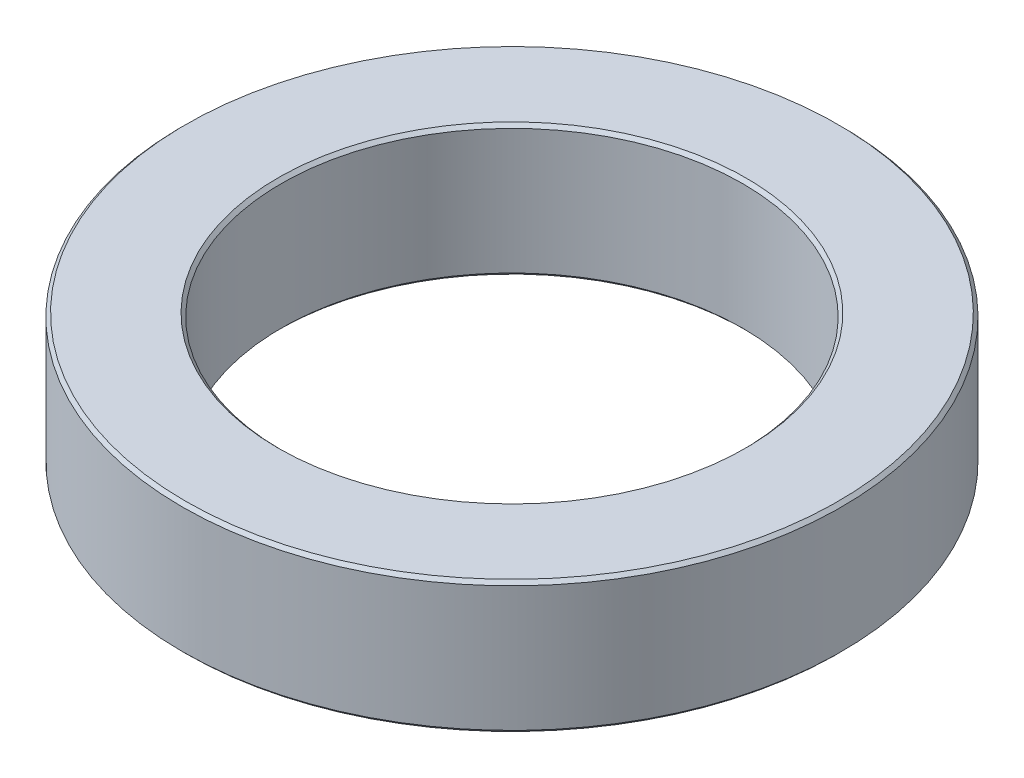
ISO-10303-21;
HEADER;
FILE_DESCRIPTION(('STEP AP214'),'2;1');
FILE_NAME('part.step','',(''),(''),'','','');
FILE_SCHEMA(('AUTOMOTIVE_DESIGN { 1 0 10303 214 1 1 1 1 }'));
ENDSEC;
DATA;
#1=APPLICATION_CONTEXT('core data for automotive mechanical design processes');
#2=APPLICATION_PROTOCOL_DEFINITION('international standard','automotive_design',2000,#1);
#3=PRODUCT_CONTEXT('',#1,'mechanical');
#4=PRODUCT('Part','Part','',(#3));
#5=PRODUCT_RELATED_PRODUCT_CATEGORY('part','',(#4));
#6=PRODUCT_DEFINITION_FORMATION('','',#4);
#7=PRODUCT_DEFINITION_CONTEXT('part definition',#1,'design');
#8=PRODUCT_DEFINITION('design','',#6,#7);
#9=PRODUCT_DEFINITION_SHAPE('','',#8);
#10=(LENGTH_UNIT() NAMED_UNIT(*) SI_UNIT(.MILLI.,.METRE.));
#11=(NAMED_UNIT(*) PLANE_ANGLE_UNIT() SI_UNIT($,.RADIAN.));
#12=(NAMED_UNIT(*) SI_UNIT($,.STERADIAN.) SOLID_ANGLE_UNIT());
#13=UNCERTAINTY_MEASURE_WITH_UNIT(LENGTH_MEASURE(1.E-05),#10,'distance_accuracy_value','');
#14=(GEOMETRIC_REPRESENTATION_CONTEXT(3) GLOBAL_UNCERTAINTY_ASSIGNED_CONTEXT((#13)) GLOBAL_UNIT_ASSIGNED_CONTEXT((#10,
#11,#12)) REPRESENTATION_CONTEXT('',''));
#15=CARTESIAN_POINT('',(0.,0.,0.));
#16=DIRECTION('',(0.,0.,1.));
#17=DIRECTION('',(1.,0.,0.));
#18=AXIS2_PLACEMENT_3D('',#15,#16,#17);
#19=CARTESIAN_POINT('',(0.,4.,0.));
#20=DIRECTION('',(0.,1.,0.));
#21=DIRECTION('',(0.,0.,1.));
#22=AXIS2_PLACEMENT_3D('',#19,#20,#21);
#23=PLANE('',#22);
#24=CARTESIAN_POINT('',(0.,4.,0.));
#25=DIRECTION('',(0.,1.,0.));
#26=DIRECTION('',(0.,0.,1.));
#27=AXIS2_PLACEMENT_3D('',#24,#25,#26);
#28=CIRCLE('',#27,14.2);
#29=CARTESIAN_POINT('',(0.,4.,14.2));
#30=VERTEX_POINT('',#29);
#31=EDGE_CURVE('E53',#30,#30,#28,.F.);
#32=ORIENTED_EDGE('',*,*,#31,.T.);
#33=EDGE_LOOP('',(#32));
#34=FACE_BOUND('',#33,.T.);
#35=CARTESIAN_POINT('',(0.,4.,0.));
#36=DIRECTION('',(0.,1.,0.));
#37=DIRECTION('',(0.,0.,1.));
#38=AXIS2_PLACEMENT_3D('',#35,#36,#37);
#39=CIRCLE('',#38,19.8);
#40=CARTESIAN_POINT('',(0.,4.,19.8));
#41=VERTEX_POINT('',#40);
#42=EDGE_CURVE('E56',#41,#41,#39,.T.);
#43=ORIENTED_EDGE('',*,*,#42,.T.);
#44=EDGE_LOOP('',(#43));
#45=FACE_BOUND('',#44,.T.);
#46=ADVANCED_FACE('F32',(#34,#45),#23,.T.);
#47=CARTESIAN_POINT('',(0.,-4.,0.));
#48=DIRECTION('',(0.,1.,0.));
#49=DIRECTION('',(0.,0.,1.));
#50=AXIS2_PLACEMENT_3D('',#47,#48,#49);
#51=PLANE('',#50);
#52=CARTESIAN_POINT('',(0.,-4.,0.));
#53=DIRECTION('',(0.,1.,0.));
#54=DIRECTION('',(0.,0.,1.));
#55=AXIS2_PLACEMENT_3D('',#52,#53,#54);
#56=CIRCLE('',#55,14.2);
#57=CARTESIAN_POINT('',(0.,-4.,14.2));
#58=VERTEX_POINT('',#57);
#59=EDGE_CURVE('E10',#58,#58,#56,.T.);
#60=ORIENTED_EDGE('',*,*,#59,.T.);
#61=EDGE_LOOP('',(#60));
#62=FACE_BOUND('',#61,.T.);
#63=CARTESIAN_POINT('',(0.,-4.,0.));
#64=DIRECTION('',(0.,1.,0.));
#65=DIRECTION('',(0.,0.,1.));
#66=AXIS2_PLACEMENT_3D('',#63,#64,#65);
#67=CIRCLE('',#66,19.8);
#68=CARTESIAN_POINT('',(0.,-4.,19.8));
#69=VERTEX_POINT('',#68);
#70=EDGE_CURVE('E40',#69,#69,#67,.F.);
#71=ORIENTED_EDGE('',*,*,#70,.T.);
#72=EDGE_LOOP('',(#71));
#73=FACE_BOUND('',#72,.T.);
#74=ADVANCED_FACE('F82',(#62,#73),#51,.F.);
#75=CARTESIAN_POINT('',(0.,4.,0.));
#76=DIRECTION('',(0.,-1.,0.));
#77=DIRECTION('',(0.,0.,-1.));
#78=AXIS2_PLACEMENT_3D('',#75,#76,#77);
#79=CYLINDRICAL_SURFACE('',#78,20.);
#80=CARTESIAN_POINT('',(0.,3.80000000000002,0.));
#81=DIRECTION('',(0.,1.,0.));
#82=DIRECTION('',(0.,0.,1.));
#83=AXIS2_PLACEMENT_3D('',#80,#81,#82);
#84=CIRCLE('',#83,20.);
#85=CARTESIAN_POINT('',(0.,3.80000000000002,20.));
#86=VERTEX_POINT('',#85);
#87=EDGE_CURVE('E44',#86,#86,#84,.F.);
#88=ORIENTED_EDGE('',*,*,#87,.T.);
#89=EDGE_LOOP('',(#88));
#90=FACE_BOUND('',#89,.T.);
#91=CARTESIAN_POINT('',(0.,-3.8,0.));
#92=DIRECTION('',(0.,1.,0.));
#93=DIRECTION('',(0.,0.,1.));
#94=AXIS2_PLACEMENT_3D('',#91,#92,#93);
#95=CIRCLE('',#94,20.);
#96=CARTESIAN_POINT('',(0.,-3.8,20.));
#97=VERTEX_POINT('',#96);
#98=EDGE_CURVE('E48',#97,#97,#95,.T.);
#99=ORIENTED_EDGE('',*,*,#98,.T.);
#100=EDGE_LOOP('',(#99));
#101=FACE_BOUND('',#100,.T.);
#102=ADVANCED_FACE('F88',(#90,#101),#79,.T.);
#103=CARTESIAN_POINT('',(0.,4.,0.));
#104=DIRECTION('',(0.,-1.,0.));
#105=DIRECTION('',(0.,0.,-1.));
#106=AXIS2_PLACEMENT_3D('',#103,#104,#105);
#107=CYLINDRICAL_SURFACE('',#106,14.);
#108=CARTESIAN_POINT('',(0.,3.8,0.));
#109=DIRECTION('',(0.,1.,0.));
#110=DIRECTION('',(0.,0.,1.));
#111=AXIS2_PLACEMENT_3D('',#108,#109,#110);
#112=CIRCLE('',#111,14.);
#113=CARTESIAN_POINT('',(0.,3.8,14.));
#114=VERTEX_POINT('',#113);
#115=EDGE_CURVE('E59',#114,#114,#112,.T.);
#116=ORIENTED_EDGE('',*,*,#115,.T.);
#117=EDGE_LOOP('',(#116));
#118=FACE_BOUND('',#117,.T.);
#119=CARTESIAN_POINT('',(0.,-3.8,0.));
#120=DIRECTION('',(0.,1.,0.));
#121=DIRECTION('',(0.,0.,1.));
#122=AXIS2_PLACEMENT_3D('',#119,#120,#121);
#123=CIRCLE('',#122,14.);
#124=CARTESIAN_POINT('',(0.,-3.8,14.));
#125=VERTEX_POINT('',#124);
#126=EDGE_CURVE('E62',#125,#125,#123,.F.);
#127=ORIENTED_EDGE('',*,*,#126,.T.);
#128=EDGE_LOOP('',(#127));
#129=FACE_BOUND('',#128,.T.);
#130=ADVANCED_FACE('F66',(#118,#129),#107,.F.);
#131=CARTESIAN_POINT('',(0.,3.8,0.));
#132=DIRECTION('',(0.,1.,0.));
#133=DIRECTION('',(0.,0.,1.));
#134=AXIS2_PLACEMENT_3D('',#131,#132,#133);
#135=CONICAL_SURFACE('',#134,14.,0.785398163397466);
#136=ORIENTED_EDGE('',*,*,#31,.F.);
#137=EDGE_LOOP('',(#136));
#138=FACE_BOUND('',#137,.T.);
#139=ORIENTED_EDGE('',*,*,#115,.F.);
#140=EDGE_LOOP('',(#139));
#141=FACE_BOUND('',#140,.T.);
#142=ADVANCED_FACE('F77',(#138,#141),#135,.F.);
#143=CARTESIAN_POINT('',(0.,4.,0.));
#144=DIRECTION('',(0.,-1.,0.));
#145=DIRECTION('',(0.,0.,-1.));
#146=AXIS2_PLACEMENT_3D('',#143,#144,#145);
#147=CONICAL_SURFACE('',#146,19.8,0.785398163397448);
#148=ORIENTED_EDGE('',*,*,#87,.F.);
#149=EDGE_LOOP('',(#148));
#150=FACE_BOUND('',#149,.T.);
#151=ORIENTED_EDGE('',*,*,#42,.F.);
#152=EDGE_LOOP('',(#151));
#153=FACE_BOUND('',#152,.T.);
#154=ADVANCED_FACE('F71',(#150,#153),#147,.T.);
#155=CARTESIAN_POINT('',(0.,-4.,0.));
#156=DIRECTION('',(0.,-1.,0.));
#157=DIRECTION('',(0.,0.,-1.));
#158=AXIS2_PLACEMENT_3D('',#155,#156,#157);
#159=CONICAL_SURFACE('',#158,14.2,0.785398163397435);
#160=ORIENTED_EDGE('',*,*,#126,.F.);
#161=EDGE_LOOP('',(#160));
#162=FACE_BOUND('',#161,.T.);
#163=ORIENTED_EDGE('',*,*,#59,.F.);
#164=EDGE_LOOP('',(#163));
#165=FACE_BOUND('',#164,.T.);
#166=ADVANCED_FACE('F68',(#162,#165),#159,.F.);
#167=CARTESIAN_POINT('',(0.,-3.8,0.));
#168=DIRECTION('',(0.,1.,0.));
#169=DIRECTION('',(0.,0.,1.));
#170=AXIS2_PLACEMENT_3D('',#167,#168,#169);
#171=CONICAL_SURFACE('',#170,20.,0.785398163397457);
#172=ORIENTED_EDGE('',*,*,#70,.F.);
#173=EDGE_LOOP('',(#172));
#174=FACE_BOUND('',#173,.T.);
#175=ORIENTED_EDGE('',*,*,#98,.F.);
#176=EDGE_LOOP('',(#175));
#177=FACE_BOUND('',#176,.T.);
#178=ADVANCED_FACE('F35',(#174,#177),#171,.T.);
#179=CLOSED_SHELL('',(#46,#74,#102,#130,#142,#154,#166,#178));
#180=MANIFOLD_SOLID_BREP('B2',#179);
#181=ADVANCED_BREP_SHAPE_REPRESENTATION('',(#18,#180),#14);
#182=SHAPE_DEFINITION_REPRESENTATION(#9,#181);
ENDSEC;
END-ISO-10303-21;
